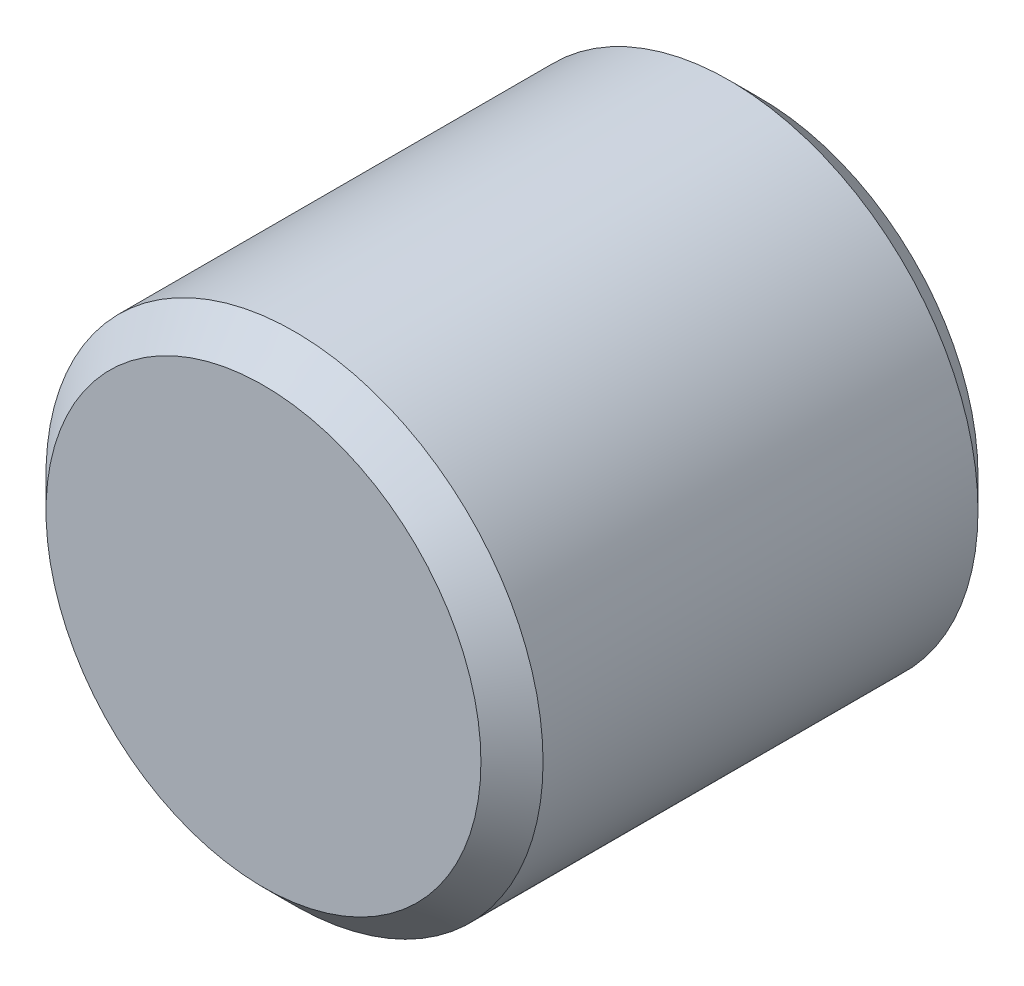
ISO-10303-21;
HEADER;
FILE_DESCRIPTION(('STEP AP214'),'2;1');
FILE_NAME('part.step','',(''),(''),'','','');
FILE_SCHEMA(('AUTOMOTIVE_DESIGN { 1 0 10303 214 1 1 1 1 }'));
ENDSEC;
DATA;
#1=APPLICATION_CONTEXT('core data for automotive mechanical design processes');
#2=APPLICATION_PROTOCOL_DEFINITION('international standard','automotive_design',2000,#1);
#3=PRODUCT_CONTEXT('',#1,'mechanical');
#4=PRODUCT('Part','Part','',(#3));
#5=PRODUCT_RELATED_PRODUCT_CATEGORY('part','',(#4));
#6=PRODUCT_DEFINITION_FORMATION('','',#4);
#7=PRODUCT_DEFINITION_CONTEXT('part definition',#1,'design');
#8=PRODUCT_DEFINITION('design','',#6,#7);
#9=PRODUCT_DEFINITION_SHAPE('','',#8);
#10=(LENGTH_UNIT() NAMED_UNIT(*) SI_UNIT(.MILLI.,.METRE.));
#11=(NAMED_UNIT(*) PLANE_ANGLE_UNIT() SI_UNIT($,.RADIAN.));
#12=(NAMED_UNIT(*) SI_UNIT($,.STERADIAN.) SOLID_ANGLE_UNIT());
#13=UNCERTAINTY_MEASURE_WITH_UNIT(LENGTH_MEASURE(1.E-05),#10,'distance_accuracy_value','');
#14=(GEOMETRIC_REPRESENTATION_CONTEXT(3) GLOBAL_UNCERTAINTY_ASSIGNED_CONTEXT((#13)) GLOBAL_UNIT_ASSIGNED_CONTEXT((#10,
#11,#12)) REPRESENTATION_CONTEXT('',''));
#15=CARTESIAN_POINT('',(0.,0.,0.));
#16=DIRECTION('',(0.,0.,1.));
#17=DIRECTION('',(1.,0.,0.));
#18=AXIS2_PLACEMENT_3D('',#15,#16,#17);
#19=CARTESIAN_POINT('',(0.,0.,4.));
#20=DIRECTION('',(0.,0.,-0.999999999999997));
#21=DIRECTION('',(-0.999999999999999,0.,0.));
#22=AXIS2_PLACEMENT_3D('',#19,#20,#21);
#23=CYLINDRICAL_SURFACE('',#22,2.);
#24=CARTESIAN_POINT('',(0.,0.,0.25));
#25=DIRECTION('',(0.,0.,0.999999999999997));
#26=DIRECTION('',(0.999999999999999,0.,0.));
#27=AXIS2_PLACEMENT_3D('',#24,#25,#26);
#28=CIRCLE('',#27,2.);
#29=CARTESIAN_POINT('',(2.,0.,0.25));
#30=VERTEX_POINT('',#29);
#31=EDGE_CURVE('E45',#30,#30,#28,.T.);
#32=ORIENTED_EDGE('',*,*,#31,.T.);
#33=EDGE_LOOP('',(#32));
#34=FACE_BOUND('',#33,.T.);
#35=CARTESIAN_POINT('',(0.,0.,3.75));
#36=DIRECTION('',(0.,0.,0.999999999999997));
#37=DIRECTION('',(0.999999999999999,0.,0.));
#38=AXIS2_PLACEMENT_3D('',#35,#36,#37);
#39=CIRCLE('',#38,2.);
#40=CARTESIAN_POINT('',(2.,0.,3.75));
#41=VERTEX_POINT('',#40);
#42=EDGE_CURVE('E49',#41,#41,#39,.F.);
#43=ORIENTED_EDGE('',*,*,#42,.T.);
#44=EDGE_LOOP('',(#43));
#45=FACE_BOUND('',#44,.T.);
#46=ADVANCED_FACE('F34',(#34,#45),#23,.T.);
#47=CARTESIAN_POINT('',(0.,0.,4.));
#48=DIRECTION('',(0.,0.,0.999999999999997));
#49=DIRECTION('',(0.999999999999999,0.,0.));
#50=AXIS2_PLACEMENT_3D('',#47,#48,#49);
#51=PLANE('',#50);
#52=CARTESIAN_POINT('',(0.,0.,4.));
#53=DIRECTION('',(0.,0.,0.999999999999997));
#54=DIRECTION('',(0.999999999999999,0.,0.));
#55=AXIS2_PLACEMENT_3D('',#52,#53,#54);
#56=CIRCLE('',#55,1.75);
#57=CARTESIAN_POINT('',(1.75,0.,4.));
#58=VERTEX_POINT('',#57);
#59=EDGE_CURVE('E10',#58,#58,#56,.T.);
#60=ORIENTED_EDGE('',*,*,#59,.T.);
#61=EDGE_LOOP('',(#60));
#62=FACE_BOUND('',#61,.T.);
#63=ADVANCED_FACE('F65',(#62),#51,.T.);
#64=CARTESIAN_POINT('',(0.,0.,0.));
#65=DIRECTION('',(0.,0.,0.999999999999997));
#66=DIRECTION('',(0.999999999999999,0.,0.));
#67=AXIS2_PLACEMENT_3D('',#64,#65,#66);
#68=PLANE('',#67);
#69=CARTESIAN_POINT('',(0.,0.,0.));
#70=DIRECTION('',(0.,0.,0.999999999999997));
#71=DIRECTION('',(0.999999999999999,0.,0.));
#72=AXIS2_PLACEMENT_3D('',#69,#70,#71);
#73=CIRCLE('',#72,1.75);
#74=CARTESIAN_POINT('',(1.75,0.,0.));
#75=VERTEX_POINT('',#74);
#76=EDGE_CURVE('E41',#75,#75,#73,.F.);
#77=ORIENTED_EDGE('',*,*,#76,.T.);
#78=EDGE_LOOP('',(#77));
#79=FACE_BOUND('',#78,.T.);
#80=ADVANCED_FACE('F62',(#79),#68,.F.);
#81=CARTESIAN_POINT('',(0.,0.,0.25));
#82=DIRECTION('',(0.,0.,0.999999999999997));
#83=DIRECTION('',(0.999999999999999,0.,0.));
#84=AXIS2_PLACEMENT_3D('',#81,#82,#83);
#85=CONICAL_SURFACE('',#84,2.,0.785398163397451);
#86=ORIENTED_EDGE('',*,*,#76,.F.);
#87=EDGE_LOOP('',(#86));
#88=FACE_BOUND('',#87,.T.);
#89=ORIENTED_EDGE('',*,*,#31,.F.);
#90=EDGE_LOOP('',(#89));
#91=FACE_BOUND('',#90,.T.);
#92=ADVANCED_FACE('F58',(#88,#91),#85,.T.);
#93=CARTESIAN_POINT('',(0.,0.,4.));
#94=DIRECTION('',(0.,0.,-0.999999999999997));
#95=DIRECTION('',(-0.999999999999999,0.,0.));
#96=AXIS2_PLACEMENT_3D('',#93,#94,#95);
#97=CONICAL_SURFACE('',#96,1.75,0.785398163397445);
#98=ORIENTED_EDGE('',*,*,#42,.F.);
#99=EDGE_LOOP('',(#98));
#100=FACE_BOUND('',#99,.T.);
#101=ORIENTED_EDGE('',*,*,#59,.F.);
#102=EDGE_LOOP('',(#101));
#103=FACE_BOUND('',#102,.T.);
#104=ADVANCED_FACE('F36',(#100,#103),#97,.T.);
#105=CLOSED_SHELL('',(#46,#63,#80,#92,#104));
#106=MANIFOLD_SOLID_BREP('B2',#105);
#107=ADVANCED_BREP_SHAPE_REPRESENTATION('',(#18,#106),#14);
#108=SHAPE_DEFINITION_REPRESENTATION(#9,#107);
ENDSEC;
END-ISO-10303-21;
